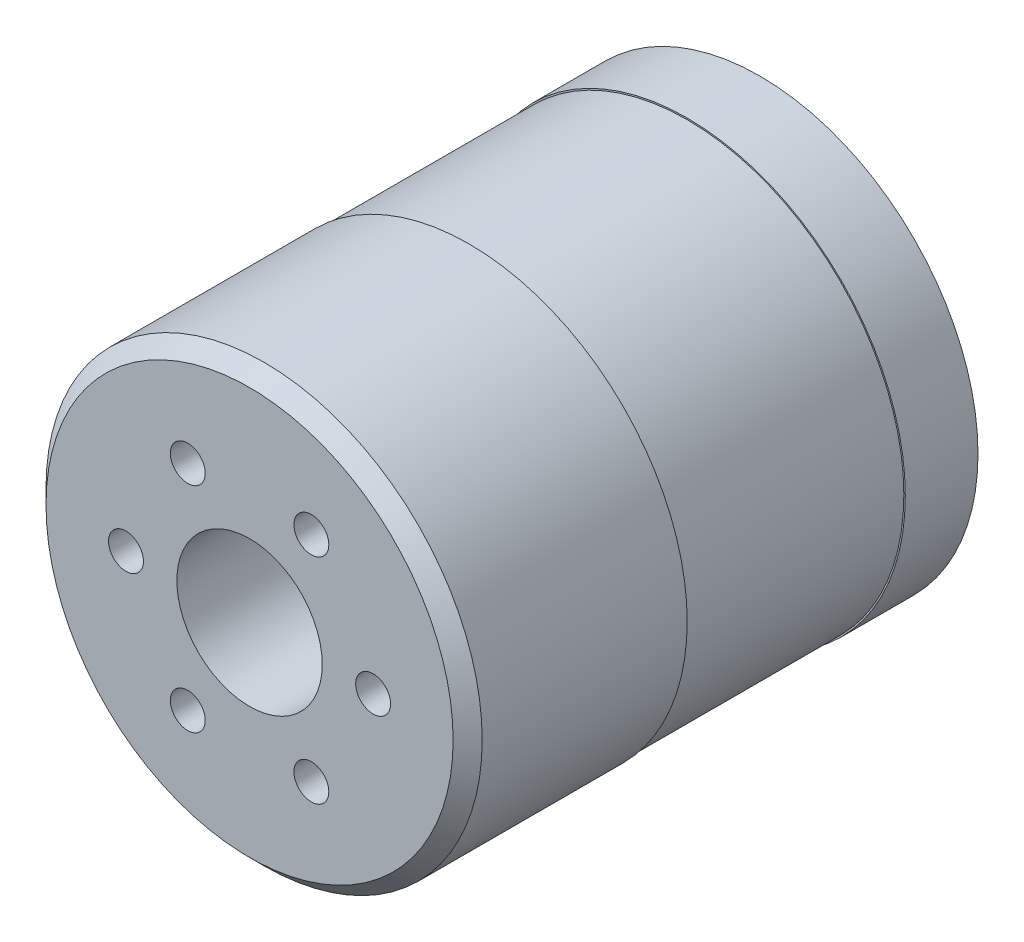
ISO-10303-21;
HEADER;
FILE_DESCRIPTION(('STEP AP214'),'2;1');
FILE_NAME('part.step','',(''),(''),'','','');
FILE_SCHEMA(('AUTOMOTIVE_DESIGN { 1 0 10303 214 1 1 1 1 }'));
ENDSEC;
DATA;
#1=APPLICATION_CONTEXT('core data for automotive mechanical design processes');
#2=APPLICATION_PROTOCOL_DEFINITION('international standard','automotive_design',2000,#1);
#3=PRODUCT_CONTEXT('',#1,'mechanical');
#4=PRODUCT('Part','Part','',(#3));
#5=PRODUCT_RELATED_PRODUCT_CATEGORY('part','',(#4));
#6=PRODUCT_DEFINITION_FORMATION('','',#4);
#7=PRODUCT_DEFINITION_CONTEXT('part definition',#1,'design');
#8=PRODUCT_DEFINITION('design','',#6,#7);
#9=PRODUCT_DEFINITION_SHAPE('','',#8);
#10=(LENGTH_UNIT() NAMED_UNIT(*) SI_UNIT(.MILLI.,.METRE.));
#11=(NAMED_UNIT(*) PLANE_ANGLE_UNIT() SI_UNIT($,.RADIAN.));
#12=(NAMED_UNIT(*) SI_UNIT($,.STERADIAN.) SOLID_ANGLE_UNIT());
#13=UNCERTAINTY_MEASURE_WITH_UNIT(LENGTH_MEASURE(1.E-05),#10,'distance_accuracy_value','');
#14=(GEOMETRIC_REPRESENTATION_CONTEXT(3) GLOBAL_UNCERTAINTY_ASSIGNED_CONTEXT((#13)) GLOBAL_UNIT_ASSIGNED_CONTEXT((#10,
#11,#12)) REPRESENTATION_CONTEXT('',''));
#15=CARTESIAN_POINT('',(0.,0.,0.));
#16=DIRECTION('',(0.,0.,1.));
#17=DIRECTION('',(1.,0.,0.));
#18=AXIS2_PLACEMENT_3D('',#15,#16,#17);
#19=CARTESIAN_POINT('',(0.,0.,0.));
#20=DIRECTION('',(0.,0.,1.));
#21=DIRECTION('',(1.,0.,0.));
#22=AXIS2_PLACEMENT_3D('',#19,#20,#21);
#23=PLANE('',#22);
#24=CARTESIAN_POINT('',(-13.,0.,0.));
#25=DIRECTION('',(0.,0.,-1.));
#26=DIRECTION('',(-1.,0.,0.));
#27=AXIS2_PLACEMENT_3D('',#24,#25,#26);
#28=CIRCLE('',#27,1.25);
#29=CARTESIAN_POINT('',(-14.25,0.,0.));
#30=VERTEX_POINT('',#29);
#31=EDGE_CURVE('E126',#30,#30,#28,.T.);
#32=ORIENTED_EDGE('',*,*,#31,.F.);
#33=EDGE_LOOP('',(#32));
#34=FACE_BOUND('',#33,.T.);
#35=CARTESIAN_POINT('',(0.,13.,0.));
#36=DIRECTION('',(0.,0.,-1.));
#37=DIRECTION('',(-1.,0.,0.));
#38=AXIS2_PLACEMENT_3D('',#35,#36,#37);
#39=CIRCLE('',#38,1.25);
#40=CARTESIAN_POINT('',(-1.25,13.,0.));
#41=VERTEX_POINT('',#40);
#42=EDGE_CURVE('E132',#41,#41,#39,.T.);
#43=ORIENTED_EDGE('',*,*,#42,.F.);
#44=EDGE_LOOP('',(#43));
#45=FACE_BOUND('',#44,.T.);
#46=CARTESIAN_POINT('',(13.,0.,0.));
#47=DIRECTION('',(0.,0.,-1.));
#48=DIRECTION('',(-1.,0.,0.));
#49=AXIS2_PLACEMENT_3D('',#46,#47,#48);
#50=CIRCLE('',#49,1.25);
#51=CARTESIAN_POINT('',(11.75,0.,0.));
#52=VERTEX_POINT('',#51);
#53=EDGE_CURVE('E138',#52,#52,#50,.T.);
#54=ORIENTED_EDGE('',*,*,#53,.F.);
#55=EDGE_LOOP('',(#54));
#56=FACE_BOUND('',#55,.T.);
#57=CARTESIAN_POINT('',(0.,-13.,0.));
#58=DIRECTION('',(0.,0.,-1.));
#59=DIRECTION('',(-1.,0.,0.));
#60=AXIS2_PLACEMENT_3D('',#57,#58,#59);
#61=CIRCLE('',#60,1.25);
#62=CARTESIAN_POINT('',(-1.25,-13.,0.));
#63=VERTEX_POINT('',#62);
#64=EDGE_CURVE('E144',#63,#63,#61,.T.);
#65=ORIENTED_EDGE('',*,*,#64,.F.);
#66=EDGE_LOOP('',(#65));
#67=FACE_BOUND('',#66,.T.);
#68=CARTESIAN_POINT('',(0.,0.,0.));
#69=DIRECTION('',(0.,0.,1.));
#70=DIRECTION('',(1.,0.,0.));
#71=AXIS2_PLACEMENT_3D('',#68,#69,#70);
#72=CIRCLE('',#71,9.);
#73=CARTESIAN_POINT('',(9.,0.,0.));
#74=VERTEX_POINT('',#73);
#75=EDGE_CURVE('E174',#74,#74,#72,.F.);
#76=ORIENTED_EDGE('',*,*,#75,.F.);
#77=EDGE_LOOP('',(#76));
#78=FACE_BOUND('',#77,.T.);
#79=CARTESIAN_POINT('',(0.,0.,0.));
#80=DIRECTION('',(0.,0.,-1.));
#81=DIRECTION('',(-1.,0.,0.));
#82=AXIS2_PLACEMENT_3D('',#79,#80,#81);
#83=CIRCLE('',#82,15.);
#84=CARTESIAN_POINT('',(-15.,0.,0.));
#85=VERTEX_POINT('',#84);
#86=EDGE_CURVE('E147',#85,#85,#83,.T.);
#87=ORIENTED_EDGE('',*,*,#86,.T.);
#88=EDGE_LOOP('',(#87));
#89=FACE_BOUND('',#88,.T.);
#90=ADVANCED_FACE('F32',(#34,#45,#56,#67,#78,#89),#23,.F.);
#91=CARTESIAN_POINT('',(0.,0.,-4.5));
#92=DIRECTION('',(0.,0.,-1.));
#93=DIRECTION('',(-1.,0.,0.));
#94=AXIS2_PLACEMENT_3D('',#91,#92,#93);
#95=PLANE('',#94);
#96=CARTESIAN_POINT('',(0.,0.,-4.5));
#97=DIRECTION('',(0.,0.,-1.));
#98=DIRECTION('',(-1.,0.,0.));
#99=AXIS2_PLACEMENT_3D('',#96,#97,#98);
#100=CIRCLE('',#99,5.);
#101=CARTESIAN_POINT('',(-5.,0.,-4.5));
#102=VERTEX_POINT('',#101);
#103=EDGE_CURVE('E166',#102,#102,#100,.T.);
#104=ORIENTED_EDGE('',*,*,#103,.T.);
#105=EDGE_LOOP('',(#104));
#106=FACE_BOUND('',#105,.T.);
#107=CARTESIAN_POINT('',(0.,0.,-4.5));
#108=DIRECTION('',(0.,0.,-1.));
#109=DIRECTION('',(-1.,0.,0.));
#110=AXIS2_PLACEMENT_3D('',#107,#108,#109);
#111=CIRCLE('',#110,4.);
#112=CARTESIAN_POINT('',(-4.,0.,-4.5));
#113=VERTEX_POINT('',#112);
#114=EDGE_CURVE('E162',#113,#113,#111,.T.);
#115=ORIENTED_EDGE('',*,*,#114,.F.);
#116=EDGE_LOOP('',(#115));
#117=FACE_BOUND('',#116,.T.);
#118=ADVANCED_FACE('F196',(#106,#117),#95,.T.);
#119=CARTESIAN_POINT('',(0.,0.,-4.));
#120=DIRECTION('',(0.,0.,-1.));
#121=DIRECTION('',(-1.,0.,0.));
#122=AXIS2_PLACEMENT_3D('',#119,#120,#121);
#123=PLANE('',#122);
#124=CARTESIAN_POINT('',(0.,0.,-4.));
#125=DIRECTION('',(0.,0.,-1.));
#126=DIRECTION('',(-1.,0.,0.));
#127=AXIS2_PLACEMENT_3D('',#124,#125,#126);
#128=CIRCLE('',#127,9.);
#129=CARTESIAN_POINT('',(-9.,0.,-4.));
#130=VERTEX_POINT('',#129);
#131=EDGE_CURVE('E169',#130,#130,#128,.T.);
#132=ORIENTED_EDGE('',*,*,#131,.T.);
#133=EDGE_LOOP('',(#132));
#134=FACE_BOUND('',#133,.T.);
#135=CARTESIAN_POINT('',(0.,0.,-4.));
#136=DIRECTION('',(0.,0.,-1.));
#137=DIRECTION('',(-1.,0.,0.));
#138=AXIS2_PLACEMENT_3D('',#135,#136,#137);
#139=CIRCLE('',#138,5.);
#140=CARTESIAN_POINT('',(-5.,0.,-4.));
#141=VERTEX_POINT('',#140);
#142=EDGE_CURVE('E165',#141,#141,#139,.T.);
#143=ORIENTED_EDGE('',*,*,#142,.F.);
#144=EDGE_LOOP('',(#143));
#145=FACE_BOUND('',#144,.T.);
#146=ADVANCED_FACE('F202',(#134,#145),#123,.T.);
#147=CARTESIAN_POINT('',(0.,0.,-4.));
#148=DIRECTION('',(0.,0.,1.));
#149=DIRECTION('',(1.,0.,0.));
#150=AXIS2_PLACEMENT_3D('',#147,#148,#149);
#151=CYLINDRICAL_SURFACE('',#150,9.);
#152=ORIENTED_EDGE('',*,*,#131,.F.);
#153=EDGE_LOOP('',(#152));
#154=FACE_BOUND('',#153,.T.);
#155=ORIENTED_EDGE('',*,*,#75,.T.);
#156=EDGE_LOOP('',(#155));
#157=FACE_BOUND('',#156,.T.);
#158=ADVANCED_FACE('F208',(#154,#157),#151,.T.);
#159=CARTESIAN_POINT('',(0.,0.,-4.5));
#160=DIRECTION('',(0.,0.,1.));
#161=DIRECTION('',(1.,0.,0.));
#162=AXIS2_PLACEMENT_3D('',#159,#160,#161);
#163=CYLINDRICAL_SURFACE('',#162,5.);
#164=ORIENTED_EDGE('',*,*,#103,.F.);
#165=EDGE_LOOP('',(#164));
#166=FACE_BOUND('',#165,.T.);
#167=ORIENTED_EDGE('',*,*,#142,.T.);
#168=EDGE_LOOP('',(#167));
#169=FACE_BOUND('',#168,.T.);
#170=ADVANCED_FACE('F211',(#166,#169),#163,.T.);
#171=CARTESIAN_POINT('',(0.,0.,-4.501));
#172=DIRECTION('',(0.,0.,1.));
#173=DIRECTION('',(1.,0.,0.));
#174=AXIS2_PLACEMENT_3D('',#171,#172,#173);
#175=CYLINDRICAL_SURFACE('',#174,4.);
#176=ORIENTED_EDGE('',*,*,#114,.T.);
#177=EDGE_LOOP('',(#176));
#178=FACE_BOUND('',#177,.T.);
#179=CARTESIAN_POINT('',(0.,0.,0.));
#180=DIRECTION('',(0.,0.,-1.));
#181=DIRECTION('',(-1.,0.,0.));
#182=AXIS2_PLACEMENT_3D('',#179,#180,#181);
#183=CIRCLE('',#182,4.);
#184=CARTESIAN_POINT('',(-4.,0.,0.));
#185=VERTEX_POINT('',#184);
#186=EDGE_CURVE('E159',#185,#185,#183,.T.);
#187=ORIENTED_EDGE('',*,*,#186,.F.);
#188=EDGE_LOOP('',(#187));
#189=FACE_BOUND('',#188,.T.);
#190=ADVANCED_FACE('F217',(#178,#189),#175,.F.);
#191=CARTESIAN_POINT('',(0.,0.,0.));
#192=DIRECTION('',(0.,0.,-1.));
#193=DIRECTION('',(-1.,0.,0.));
#194=AXIS2_PLACEMENT_3D('',#191,#192,#193);
#195=PLANE('',#194);
#196=ORIENTED_EDGE('',*,*,#186,.T.);
#197=EDGE_LOOP('',(#196));
#198=FACE_BOUND('',#197,.T.);
#199=ADVANCED_FACE('F222',(#198),#195,.T.);
#200=CARTESIAN_POINT('',(0.,0.,5.));
#201=DIRECTION('',(0.,0.,-1.));
#202=DIRECTION('',(-1.,0.,0.));
#203=AXIS2_PLACEMENT_3D('',#200,#201,#202);
#204=CYLINDRICAL_SURFACE('',#203,15.);
#205=CARTESIAN_POINT('',(0.,0.,5.));
#206=DIRECTION('',(0.,0.,-1.));
#207=DIRECTION('',(-1.,0.,0.));
#208=AXIS2_PLACEMENT_3D('',#205,#206,#207);
#209=CIRCLE('',#208,15.);
#210=CARTESIAN_POINT('',(-15.,0.,5.));
#211=VERTEX_POINT('',#210);
#212=EDGE_CURVE('E148',#211,#211,#209,.T.);
#213=ORIENTED_EDGE('',*,*,#212,.T.);
#214=EDGE_LOOP('',(#213));
#215=FACE_BOUND('',#214,.T.);
#216=ORIENTED_EDGE('',*,*,#86,.F.);
#217=EDGE_LOOP('',(#216));
#218=FACE_BOUND('',#217,.T.);
#219=ADVANCED_FACE('F226',(#215,#218),#204,.T.);
#220=CARTESIAN_POINT('',(0.,0.,5.));
#221=DIRECTION('',(0.,0.,-1.));
#222=DIRECTION('',(-1.,0.,0.));
#223=AXIS2_PLACEMENT_3D('',#220,#221,#222);
#224=PLANE('',#223);
#225=CARTESIAN_POINT('',(0.,0.,5.));
#226=DIRECTION('',(0.,0.,-1.));
#227=DIRECTION('',(-1.,0.,0.));
#228=AXIS2_PLACEMENT_3D('',#225,#226,#227);
#229=CIRCLE('',#228,14.9);
#230=CARTESIAN_POINT('',(-14.9,0.,5.));
#231=VERTEX_POINT('',#230);
#232=EDGE_CURVE('E36',#231,#231,#229,.F.);
#233=ORIENTED_EDGE('',*,*,#232,.F.);
#234=EDGE_LOOP('',(#233));
#235=FACE_BOUND('',#234,.T.);
#236=ORIENTED_EDGE('',*,*,#212,.F.);
#237=EDGE_LOOP('',(#236));
#238=FACE_BOUND('',#237,.T.);
#239=ADVANCED_FACE('F191',(#235,#238),#224,.F.);
#240=CARTESIAN_POINT('',(0.,0.,35.1));
#241=DIRECTION('',(0.,0.,1.));
#242=DIRECTION('',(1.,0.,0.));
#243=AXIS2_PLACEMENT_3D('',#240,#241,#242);
#244=PLANE('',#243);
#245=CARTESIAN_POINT('',(4.25000000000004,-7.36121593216771,35.1));
#246=DIRECTION('',(0.,0.,1.));
#247=DIRECTION('',(1.,0.,0.));
#248=AXIS2_PLACEMENT_3D('',#245,#246,#247);
#249=CIRCLE('',#248,1.19999999999999);
#250=CARTESIAN_POINT('',(5.45000000000003,-7.36121593216771,35.1));
#251=VERTEX_POINT('',#250);
#252=EDGE_CURVE('E83',#251,#251,#249,.T.);
#253=ORIENTED_EDGE('',*,*,#252,.F.);
#254=EDGE_LOOP('',(#253));
#255=FACE_BOUND('',#254,.T.);
#256=CARTESIAN_POINT('',(-4.24999999999998,-7.36121593216774,35.1));
#257=DIRECTION('',(0.,0.,1.));
#258=DIRECTION('',(1.,0.,0.));
#259=AXIS2_PLACEMENT_3D('',#256,#257,#258);
#260=CIRCLE('',#259,1.19999999999999);
#261=CARTESIAN_POINT('',(-3.04999999999999,-7.36121593216774,35.1));
#262=VERTEX_POINT('',#261);
#263=EDGE_CURVE('E82',#262,#262,#260,.T.);
#264=ORIENTED_EDGE('',*,*,#263,.F.);
#265=EDGE_LOOP('',(#264));
#266=FACE_BOUND('',#265,.T.);
#267=CARTESIAN_POINT('',(-8.5,0.,35.1));
#268=DIRECTION('',(0.,0.,1.));
#269=DIRECTION('',(1.,0.,0.));
#270=AXIS2_PLACEMENT_3D('',#267,#268,#269);
#271=CIRCLE('',#270,1.19999999999999);
#272=CARTESIAN_POINT('',(-7.30000000000001,0.,35.1));
#273=VERTEX_POINT('',#272);
#274=EDGE_CURVE('E93',#273,#273,#271,.T.);
#275=ORIENTED_EDGE('',*,*,#274,.F.);
#276=EDGE_LOOP('',(#275));
#277=FACE_BOUND('',#276,.T.);
#278=CARTESIAN_POINT('',(-4.25000000000004,7.36121593216771,35.1));
#279=DIRECTION('',(0.,0.,1.));
#280=DIRECTION('',(1.,0.,0.));
#281=AXIS2_PLACEMENT_3D('',#278,#279,#280);
#282=CIRCLE('',#281,1.19999999999999);
#283=CARTESIAN_POINT('',(-3.05000000000005,7.36121593216771,35.1));
#284=VERTEX_POINT('',#283);
#285=EDGE_CURVE('E99',#284,#284,#282,.T.);
#286=ORIENTED_EDGE('',*,*,#285,.F.);
#287=EDGE_LOOP('',(#286));
#288=FACE_BOUND('',#287,.T.);
#289=CARTESIAN_POINT('',(4.24999999999998,7.36121593216774,35.1));
#290=DIRECTION('',(0.,0.,1.));
#291=DIRECTION('',(1.,0.,0.));
#292=AXIS2_PLACEMENT_3D('',#289,#290,#291);
#293=CIRCLE('',#292,1.19999999999999);
#294=CARTESIAN_POINT('',(5.44999999999997,7.36121593216774,35.1));
#295=VERTEX_POINT('',#294);
#296=EDGE_CURVE('E105',#295,#295,#293,.T.);
#297=ORIENTED_EDGE('',*,*,#296,.F.);
#298=EDGE_LOOP('',(#297));
#299=FACE_BOUND('',#298,.T.);
#300=CARTESIAN_POINT('',(8.5,0.,35.1));
#301=DIRECTION('',(0.,0.,1.));
#302=DIRECTION('',(1.,0.,0.));
#303=AXIS2_PLACEMENT_3D('',#300,#301,#302);
#304=CIRCLE('',#303,1.19999999999999);
#305=CARTESIAN_POINT('',(9.69999999999999,0.,35.1));
#306=VERTEX_POINT('',#305);
#307=EDGE_CURVE('E111',#306,#306,#304,.T.);
#308=ORIENTED_EDGE('',*,*,#307,.F.);
#309=EDGE_LOOP('',(#308));
#310=FACE_BOUND('',#309,.T.);
#311=CARTESIAN_POINT('',(0.,0.,35.1));
#312=DIRECTION('',(0.,0.,1.));
#313=DIRECTION('',(1.,0.,0.));
#314=AXIS2_PLACEMENT_3D('',#311,#312,#313);
#315=CIRCLE('',#314,5.);
#316=CARTESIAN_POINT('',(5.,0.,35.1));
#317=VERTEX_POINT('',#316);
#318=EDGE_CURVE('E117',#317,#317,#315,.T.);
#319=ORIENTED_EDGE('',*,*,#318,.F.);
#320=EDGE_LOOP('',(#319));
#321=FACE_BOUND('',#320,.T.);
#322=CARTESIAN_POINT('',(0.,0.,35.1));
#323=DIRECTION('',(0.,0.,1.));
#324=DIRECTION('',(1.,0.,0.));
#325=AXIS2_PLACEMENT_3D('',#322,#323,#324);
#326=CIRCLE('',#325,14.);
#327=CARTESIAN_POINT('',(14.,0.,35.1));
#328=VERTEX_POINT('',#327);
#329=EDGE_CURVE('E41',#328,#328,#326,.T.);
#330=ORIENTED_EDGE('',*,*,#329,.T.);
#331=EDGE_LOOP('',(#330));
#332=FACE_BOUND('',#331,.T.);
#333=ADVANCED_FACE('F180',(#255,#266,#277,#288,#299,#310,#321,#332),#244,.T.);
#334=CARTESIAN_POINT('',(0.,0.,35.1));
#335=DIRECTION('',(0.,0.,-1.));
#336=DIRECTION('',(-1.,0.,0.));
#337=AXIS2_PLACEMENT_3D('',#334,#335,#336);
#338=CONICAL_SURFACE('',#337,14.,0.785398163397446);
#339=CARTESIAN_POINT('',(0.,0.,34.1));
#340=DIRECTION('',(0.,0.,1.));
#341=DIRECTION('',(1.,0.,0.));
#342=AXIS2_PLACEMENT_3D('',#339,#340,#341);
#343=CIRCLE('',#342,15.);
#344=CARTESIAN_POINT('',(15.,0.,34.1));
#345=VERTEX_POINT('',#344);
#346=EDGE_CURVE('E11',#345,#345,#343,.F.);
#347=ORIENTED_EDGE('',*,*,#346,.F.);
#348=EDGE_LOOP('',(#347));
#349=FACE_BOUND('',#348,.T.);
#350=ORIENTED_EDGE('',*,*,#329,.F.);
#351=EDGE_LOOP('',(#350));
#352=FACE_BOUND('',#351,.T.);
#353=ADVANCED_FACE('F34',(#349,#352),#338,.T.);
#354=CARTESIAN_POINT('',(0.,0.,35.1));
#355=DIRECTION('',(0.,0.,-1.));
#356=DIRECTION('',(-1.,0.,0.));
#357=AXIS2_PLACEMENT_3D('',#354,#355,#356);
#358=CYLINDRICAL_SURFACE('',#357,15.);
#359=ORIENTED_EDGE('',*,*,#346,.T.);
#360=EDGE_LOOP('',(#359));
#361=FACE_BOUND('',#360,.T.);
#362=CARTESIAN_POINT('',(0.,0.,20.));
#363=DIRECTION('',(0.,0.,-1.));
#364=DIRECTION('',(-1.,0.,0.));
#365=AXIS2_PLACEMENT_3D('',#362,#363,#364);
#366=CIRCLE('',#365,15.);
#367=CARTESIAN_POINT('',(-15.,0.,20.));
#368=VERTEX_POINT('',#367);
#369=EDGE_CURVE('E156',#368,#368,#366,.T.);
#370=ORIENTED_EDGE('',*,*,#369,.F.);
#371=EDGE_LOOP('',(#370));
#372=FACE_BOUND('',#371,.T.);
#373=ADVANCED_FACE('F183',(#361,#372),#358,.T.);
#374=CARTESIAN_POINT('',(0.,0.,20.));
#375=DIRECTION('',(0.,0.,-1.));
#376=DIRECTION('',(-1.,0.,0.));
#377=AXIS2_PLACEMENT_3D('',#374,#375,#376);
#378=PLANE('',#377);
#379=CARTESIAN_POINT('',(0.,0.,20.));
#380=DIRECTION('',(0.,0.,-1.));
#381=DIRECTION('',(-1.,0.,0.));
#382=AXIS2_PLACEMENT_3D('',#379,#380,#381);
#383=CIRCLE('',#382,14.9);
#384=CARTESIAN_POINT('',(-14.9,0.,20.));
#385=VERTEX_POINT('',#384);
#386=EDGE_CURVE('E153',#385,#385,#383,.T.);
#387=ORIENTED_EDGE('',*,*,#386,.F.);
#388=EDGE_LOOP('',(#387));
#389=FACE_BOUND('',#388,.T.);
#390=ORIENTED_EDGE('',*,*,#369,.T.);
#391=EDGE_LOOP('',(#390));
#392=FACE_BOUND('',#391,.T.);
#393=ADVANCED_FACE('F189',(#389,#392),#378,.T.);
#394=CARTESIAN_POINT('',(0.,0.,20.));
#395=DIRECTION('',(0.,0.,-1.));
#396=DIRECTION('',(-1.,0.,0.));
#397=AXIS2_PLACEMENT_3D('',#394,#395,#396);
#398=CYLINDRICAL_SURFACE('',#397,14.9);
#399=ORIENTED_EDGE('',*,*,#386,.T.);
#400=EDGE_LOOP('',(#399));
#401=FACE_BOUND('',#400,.T.);
#402=ORIENTED_EDGE('',*,*,#232,.T.);
#403=EDGE_LOOP('',(#402));
#404=FACE_BOUND('',#403,.T.);
#405=ADVANCED_FACE('F230',(#401,#404),#398,.T.);
#406=CARTESIAN_POINT('',(0.,-13.,0.));
#407=DIRECTION('',(0.,0.,-1.));
#408=DIRECTION('',(-1.,0.,0.));
#409=AXIS2_PLACEMENT_3D('',#406,#407,#408);
#410=CYLINDRICAL_SURFACE('',#409,1.25);
#411=CARTESIAN_POINT('',(0.,-13.,4.5));
#412=DIRECTION('',(0.,0.,-1.));
#413=DIRECTION('',(-1.,0.,0.));
#414=AXIS2_PLACEMENT_3D('',#411,#412,#413);
#415=CIRCLE('',#414,1.25);
#416=CARTESIAN_POINT('',(-1.25,-13.,4.5));
#417=VERTEX_POINT('',#416);
#418=EDGE_CURVE('E141',#417,#417,#415,.T.);
#419=ORIENTED_EDGE('',*,*,#418,.F.);
#420=EDGE_LOOP('',(#419));
#421=FACE_BOUND('',#420,.T.);
#422=ORIENTED_EDGE('',*,*,#64,.T.);
#423=EDGE_LOOP('',(#422));
#424=FACE_BOUND('',#423,.T.);
#425=ADVANCED_FACE('F234',(#421,#424),#410,.F.);
#426=CARTESIAN_POINT('',(0.,-13.,4.5));
#427=DIRECTION('',(0.,0.,-1.));
#428=DIRECTION('',(-1.,0.,0.));
#429=AXIS2_PLACEMENT_3D('',#426,#427,#428);
#430=CONICAL_SURFACE('',#429,1.25,1.02974425867665);
#431=CARTESIAN_POINT('',(0.,-13.,5.25107577378445));
#432=VERTEX_POINT('',#431);
#433=VERTEX_LOOP('',#432);
#434=FACE_BOUND('',#433,.T.);
#435=ORIENTED_EDGE('',*,*,#418,.T.);
#436=EDGE_LOOP('',(#435));
#437=FACE_BOUND('',#436,.T.);
#438=ADVANCED_FACE('F244',(#434,#437),#430,.F.);
#439=CARTESIAN_POINT('',(13.,0.,0.));
#440=DIRECTION('',(0.,0.,-1.));
#441=DIRECTION('',(-1.,0.,0.));
#442=AXIS2_PLACEMENT_3D('',#439,#440,#441);
#443=CYLINDRICAL_SURFACE('',#442,1.25);
#444=CARTESIAN_POINT('',(13.,0.,4.5));
#445=DIRECTION('',(0.,0.,-1.));
#446=DIRECTION('',(-1.,0.,0.));
#447=AXIS2_PLACEMENT_3D('',#444,#445,#446);
#448=CIRCLE('',#447,1.25);
#449=CARTESIAN_POINT('',(11.75,0.,4.5));
#450=VERTEX_POINT('',#449);
#451=EDGE_CURVE('E135',#450,#450,#448,.T.);
#452=ORIENTED_EDGE('',*,*,#451,.F.);
#453=EDGE_LOOP('',(#452));
#454=FACE_BOUND('',#453,.T.);
#455=ORIENTED_EDGE('',*,*,#53,.T.);
#456=EDGE_LOOP('',(#455));
#457=FACE_BOUND('',#456,.T.);
#458=ADVANCED_FACE('F248',(#454,#457),#443,.F.);
#459=CARTESIAN_POINT('',(13.,0.,4.5));
#460=DIRECTION('',(0.,0.,-1.));
#461=DIRECTION('',(-1.,0.,0.));
#462=AXIS2_PLACEMENT_3D('',#459,#460,#461);
#463=CONICAL_SURFACE('',#462,1.25,1.02974425867665);
#464=CARTESIAN_POINT('',(13.,0.,5.25107577378445));
#465=VERTEX_POINT('',#464);
#466=VERTEX_LOOP('',#465);
#467=FACE_BOUND('',#466,.T.);
#468=ORIENTED_EDGE('',*,*,#451,.T.);
#469=EDGE_LOOP('',(#468));
#470=FACE_BOUND('',#469,.T.);
#471=ADVANCED_FACE('F251',(#467,#470),#463,.F.);
#472=CARTESIAN_POINT('',(0.,13.,0.));
#473=DIRECTION('',(0.,0.,-1.));
#474=DIRECTION('',(-1.,0.,0.));
#475=AXIS2_PLACEMENT_3D('',#472,#473,#474);
#476=CYLINDRICAL_SURFACE('',#475,1.25);
#477=CARTESIAN_POINT('',(0.,13.,4.5));
#478=DIRECTION('',(0.,0.,-1.));
#479=DIRECTION('',(-1.,0.,0.));
#480=AXIS2_PLACEMENT_3D('',#477,#478,#479);
#481=CIRCLE('',#480,1.25);
#482=CARTESIAN_POINT('',(-1.25,13.,4.5));
#483=VERTEX_POINT('',#482);
#484=EDGE_CURVE('E129',#483,#483,#481,.T.);
#485=ORIENTED_EDGE('',*,*,#484,.F.);
#486=EDGE_LOOP('',(#485));
#487=FACE_BOUND('',#486,.T.);
#488=ORIENTED_EDGE('',*,*,#42,.T.);
#489=EDGE_LOOP('',(#488));
#490=FACE_BOUND('',#489,.T.);
#491=ADVANCED_FACE('F255',(#487,#490),#476,.F.);
#492=CARTESIAN_POINT('',(0.,13.,4.5));
#493=DIRECTION('',(0.,0.,-1.));
#494=DIRECTION('',(-1.,0.,0.));
#495=AXIS2_PLACEMENT_3D('',#492,#493,#494);
#496=CONICAL_SURFACE('',#495,1.25,1.02974425867665);
#497=CARTESIAN_POINT('',(0.,13.,5.25107577378445));
#498=VERTEX_POINT('',#497);
#499=VERTEX_LOOP('',#498);
#500=FACE_BOUND('',#499,.T.);
#501=ORIENTED_EDGE('',*,*,#484,.T.);
#502=EDGE_LOOP('',(#501));
#503=FACE_BOUND('',#502,.T.);
#504=ADVANCED_FACE('F258',(#500,#503),#496,.F.);
#505=CARTESIAN_POINT('',(-13.,0.,0.));
#506=DIRECTION('',(0.,0.,-1.));
#507=DIRECTION('',(-1.,0.,0.));
#508=AXIS2_PLACEMENT_3D('',#505,#506,#507);
#509=CYLINDRICAL_SURFACE('',#508,1.25);
#510=CARTESIAN_POINT('',(-13.,0.,4.5));
#511=DIRECTION('',(0.,0.,-1.));
#512=DIRECTION('',(-1.,0.,0.));
#513=AXIS2_PLACEMENT_3D('',#510,#511,#512);
#514=CIRCLE('',#513,1.25);
#515=CARTESIAN_POINT('',(-14.25,0.,4.5));
#516=VERTEX_POINT('',#515);
#517=EDGE_CURVE('E121',#516,#516,#514,.T.);
#518=ORIENTED_EDGE('',*,*,#517,.F.);
#519=EDGE_LOOP('',(#518));
#520=FACE_BOUND('',#519,.T.);
#521=ORIENTED_EDGE('',*,*,#31,.T.);
#522=EDGE_LOOP('',(#521));
#523=FACE_BOUND('',#522,.T.);
#524=ADVANCED_FACE('F262',(#520,#523),#509,.F.);
#525=CARTESIAN_POINT('',(-13.,0.,4.5));
#526=DIRECTION('',(0.,0.,-1.));
#527=DIRECTION('',(-1.,0.,0.));
#528=AXIS2_PLACEMENT_3D('',#525,#526,#527);
#529=CONICAL_SURFACE('',#528,1.25,1.02974425867665);
#530=CARTESIAN_POINT('',(-13.,0.,5.25107577378445));
#531=VERTEX_POINT('',#530);
#532=VERTEX_LOOP('',#531);
#533=FACE_BOUND('',#532,.T.);
#534=ORIENTED_EDGE('',*,*,#517,.T.);
#535=EDGE_LOOP('',(#534));
#536=FACE_BOUND('',#535,.T.);
#537=ADVANCED_FACE('F266',(#533,#536),#529,.F.);
#538=CARTESIAN_POINT('',(0.,0.,20.1));
#539=DIRECTION('',(0.,0.,1.));
#540=DIRECTION('',(1.,0.,0.));
#541=AXIS2_PLACEMENT_3D('',#538,#539,#540);
#542=CYLINDRICAL_SURFACE('',#541,5.);
#543=CARTESIAN_POINT('',(0.,0.,20.1));
#544=DIRECTION('',(0.,0.,1.));
#545=DIRECTION('',(1.,0.,0.));
#546=AXIS2_PLACEMENT_3D('',#543,#544,#545);
#547=CIRCLE('',#546,5.);
#548=CARTESIAN_POINT('',(5.,0.,20.1));
#549=VERTEX_POINT('',#548);
#550=EDGE_CURVE('E118',#549,#549,#547,.T.);
#551=ORIENTED_EDGE('',*,*,#550,.F.);
#552=EDGE_LOOP('',(#551));
#553=FACE_BOUND('',#552,.T.);
#554=ORIENTED_EDGE('',*,*,#318,.T.);
#555=EDGE_LOOP('',(#554));
#556=FACE_BOUND('',#555,.T.);
#557=ADVANCED_FACE('F270',(#553,#556),#542,.F.);
#558=CARTESIAN_POINT('',(0.,0.,20.1));
#559=DIRECTION('',(0.,0.,1.));
#560=DIRECTION('',(1.,0.,0.));
#561=AXIS2_PLACEMENT_3D('',#558,#559,#560);
#562=PLANE('',#561);
#563=ORIENTED_EDGE('',*,*,#550,.T.);
#564=EDGE_LOOP('',(#563));
#565=FACE_BOUND('',#564,.T.);
#566=ADVANCED_FACE('F274',(#565),#562,.T.);
#567=CARTESIAN_POINT('',(8.5,0.,32.1));
#568=DIRECTION('',(0.,0.,1.));
#569=DIRECTION('',(1.,0.,0.));
#570=AXIS2_PLACEMENT_3D('',#567,#568,#569);
#571=CONICAL_SURFACE('',#570,1.2,1.02974425867666);
#572=CARTESIAN_POINT('',(8.5,0.,31.3789672571669));
#573=VERTEX_POINT('',#572);
#574=VERTEX_LOOP('',#573);
#575=FACE_BOUND('',#574,.T.);
#576=CARTESIAN_POINT('',(8.5,0.,32.1));
#577=DIRECTION('',(0.,0.,1.));
#578=DIRECTION('',(1.,0.,0.));
#579=AXIS2_PLACEMENT_3D('',#576,#577,#578);
#580=CIRCLE('',#579,1.2);
#581=CARTESIAN_POINT('',(9.7,0.,32.1));
#582=VERTEX_POINT('',#581);
#583=EDGE_CURVE('E114',#582,#582,#580,.T.);
#584=ORIENTED_EDGE('',*,*,#583,.T.);
#585=EDGE_LOOP('',(#584));
#586=FACE_BOUND('',#585,.T.);
#587=ADVANCED_FACE('F278',(#575,#586),#571,.F.);
#588=CARTESIAN_POINT('',(8.5,0.,35.1));
#589=DIRECTION('',(0.,0.,1.));
#590=DIRECTION('',(1.,0.,0.));
#591=AXIS2_PLACEMENT_3D('',#588,#589,#590);
#592=CYLINDRICAL_SURFACE('',#591,1.19999999999999);
#593=ORIENTED_EDGE('',*,*,#583,.F.);
#594=EDGE_LOOP('',(#593));
#595=FACE_BOUND('',#594,.T.);
#596=ORIENTED_EDGE('',*,*,#307,.T.);
#597=EDGE_LOOP('',(#596));
#598=FACE_BOUND('',#597,.T.);
#599=ADVANCED_FACE('F282',(#595,#598),#592,.F.);
#600=CARTESIAN_POINT('',(4.24999999999998,7.36121593216774,32.1));
#601=DIRECTION('',(0.,0.,1.));
#602=DIRECTION('',(1.,0.,0.));
#603=AXIS2_PLACEMENT_3D('',#600,#601,#602);
#604=CONICAL_SURFACE('',#603,1.2,1.02974425867666);
#605=CARTESIAN_POINT('',(4.24999999999998,7.36121593216774,31.3789672571669));
#606=VERTEX_POINT('',#605);
#607=VERTEX_LOOP('',#606);
#608=FACE_BOUND('',#607,.T.);
#609=CARTESIAN_POINT('',(4.24999999999998,7.36121593216774,32.1));
#610=DIRECTION('',(0.,0.,1.));
#611=DIRECTION('',(1.,0.,0.));
#612=AXIS2_PLACEMENT_3D('',#609,#610,#611);
#613=CIRCLE('',#612,1.2);
#614=CARTESIAN_POINT('',(5.44999999999998,7.36121593216774,32.1));
#615=VERTEX_POINT('',#614);
#616=EDGE_CURVE('E108',#615,#615,#613,.T.);
#617=ORIENTED_EDGE('',*,*,#616,.T.);
#618=EDGE_LOOP('',(#617));
#619=FACE_BOUND('',#618,.T.);
#620=ADVANCED_FACE('F286',(#608,#619),#604,.F.);
#621=CARTESIAN_POINT('',(4.24999999999998,7.36121593216774,35.1));
#622=DIRECTION('',(0.,0.,1.));
#623=DIRECTION('',(1.,0.,0.));
#624=AXIS2_PLACEMENT_3D('',#621,#622,#623);
#625=CYLINDRICAL_SURFACE('',#624,1.19999999999999);
#626=ORIENTED_EDGE('',*,*,#616,.F.);
#627=EDGE_LOOP('',(#626));
#628=FACE_BOUND('',#627,.T.);
#629=ORIENTED_EDGE('',*,*,#296,.T.);
#630=EDGE_LOOP('',(#629));
#631=FACE_BOUND('',#630,.T.);
#632=ADVANCED_FACE('F290',(#628,#631),#625,.F.);
#633=CARTESIAN_POINT('',(-4.25000000000004,7.36121593216771,32.1));
#634=DIRECTION('',(0.,0.,1.));
#635=DIRECTION('',(1.,0.,0.));
#636=AXIS2_PLACEMENT_3D('',#633,#634,#635);
#637=CONICAL_SURFACE('',#636,1.2,1.02974425867666);
#638=CARTESIAN_POINT('',(-4.25000000000004,7.36121593216771,31.3789672571669));
#639=VERTEX_POINT('',#638);
#640=VERTEX_LOOP('',#639);
#641=FACE_BOUND('',#640,.T.);
#642=CARTESIAN_POINT('',(-4.25000000000004,7.36121593216771,32.1));
#643=DIRECTION('',(0.,0.,1.));
#644=DIRECTION('',(1.,0.,0.));
#645=AXIS2_PLACEMENT_3D('',#642,#643,#644);
#646=CIRCLE('',#645,1.2);
#647=CARTESIAN_POINT('',(-3.05000000000004,7.36121593216771,32.1));
#648=VERTEX_POINT('',#647);
#649=EDGE_CURVE('E102',#648,#648,#646,.T.);
#650=ORIENTED_EDGE('',*,*,#649,.T.);
#651=EDGE_LOOP('',(#650));
#652=FACE_BOUND('',#651,.T.);
#653=ADVANCED_FACE('F294',(#641,#652),#637,.F.);
#654=CARTESIAN_POINT('',(-4.25000000000004,7.36121593216771,35.1));
#655=DIRECTION('',(0.,0.,1.));
#656=DIRECTION('',(1.,0.,0.));
#657=AXIS2_PLACEMENT_3D('',#654,#655,#656);
#658=CYLINDRICAL_SURFACE('',#657,1.19999999999999);
#659=ORIENTED_EDGE('',*,*,#649,.F.);
#660=EDGE_LOOP('',(#659));
#661=FACE_BOUND('',#660,.T.);
#662=ORIENTED_EDGE('',*,*,#285,.T.);
#663=EDGE_LOOP('',(#662));
#664=FACE_BOUND('',#663,.T.);
#665=ADVANCED_FACE('F298',(#661,#664),#658,.F.);
#666=CARTESIAN_POINT('',(-8.5,0.,32.1));
#667=DIRECTION('',(0.,0.,1.));
#668=DIRECTION('',(1.,0.,0.));
#669=AXIS2_PLACEMENT_3D('',#666,#667,#668);
#670=CONICAL_SURFACE('',#669,1.2,1.02974425867666);
#671=CARTESIAN_POINT('',(-8.5,0.,31.3789672571669));
#672=VERTEX_POINT('',#671);
#673=VERTEX_LOOP('',#672);
#674=FACE_BOUND('',#673,.T.);
#675=CARTESIAN_POINT('',(-8.5,0.,32.1));
#676=DIRECTION('',(0.,0.,1.));
#677=DIRECTION('',(1.,0.,0.));
#678=AXIS2_PLACEMENT_3D('',#675,#676,#677);
#679=CIRCLE('',#678,1.2);
#680=CARTESIAN_POINT('',(-7.3,0.,32.1));
#681=VERTEX_POINT('',#680);
#682=EDGE_CURVE('E96',#681,#681,#679,.T.);
#683=ORIENTED_EDGE('',*,*,#682,.T.);
#684=EDGE_LOOP('',(#683));
#685=FACE_BOUND('',#684,.T.);
#686=ADVANCED_FACE('F302',(#674,#685),#670,.F.);
#687=CARTESIAN_POINT('',(-8.5,0.,35.1));
#688=DIRECTION('',(0.,0.,1.));
#689=DIRECTION('',(1.,0.,0.));
#690=AXIS2_PLACEMENT_3D('',#687,#688,#689);
#691=CYLINDRICAL_SURFACE('',#690,1.19999999999999);
#692=ORIENTED_EDGE('',*,*,#682,.F.);
#693=EDGE_LOOP('',(#692));
#694=FACE_BOUND('',#693,.T.);
#695=ORIENTED_EDGE('',*,*,#274,.T.);
#696=EDGE_LOOP('',(#695));
#697=FACE_BOUND('',#696,.T.);
#698=ADVANCED_FACE('F306',(#694,#697),#691,.F.);
#699=CARTESIAN_POINT('',(-4.24999999999998,-7.36121593216774,32.1));
#700=DIRECTION('',(0.,0.,1.));
#701=DIRECTION('',(1.,0.,0.));
#702=AXIS2_PLACEMENT_3D('',#699,#700,#701);
#703=CONICAL_SURFACE('',#702,1.2,1.02974425867666);
#704=CARTESIAN_POINT('',(-4.24999999999998,-7.36121593216774,31.3789672571669));
#705=VERTEX_POINT('',#704);
#706=VERTEX_LOOP('',#705);
#707=FACE_BOUND('',#706,.T.);
#708=CARTESIAN_POINT('',(-4.24999999999998,-7.36121593216774,32.1));
#709=DIRECTION('',(0.,0.,1.));
#710=DIRECTION('',(1.,0.,0.));
#711=AXIS2_PLACEMENT_3D('',#708,#709,#710);
#712=CIRCLE('',#711,1.2);
#713=CARTESIAN_POINT('',(-3.04999999999998,-7.36121593216774,32.1));
#714=VERTEX_POINT('',#713);
#715=EDGE_CURVE('E86',#714,#714,#712,.T.);
#716=ORIENTED_EDGE('',*,*,#715,.T.);
#717=EDGE_LOOP('',(#716));
#718=FACE_BOUND('',#717,.T.);
#719=ADVANCED_FACE('F310',(#707,#718),#703,.F.);
#720=CARTESIAN_POINT('',(-4.24999999999998,-7.36121593216774,35.1));
#721=DIRECTION('',(0.,0.,1.));
#722=DIRECTION('',(1.,0.,0.));
#723=AXIS2_PLACEMENT_3D('',#720,#721,#722);
#724=CYLINDRICAL_SURFACE('',#723,1.19999999999999);
#725=ORIENTED_EDGE('',*,*,#715,.F.);
#726=EDGE_LOOP('',(#725));
#727=FACE_BOUND('',#726,.T.);
#728=ORIENTED_EDGE('',*,*,#263,.T.);
#729=EDGE_LOOP('',(#728));
#730=FACE_BOUND('',#729,.T.);
#731=ADVANCED_FACE('F76',(#727,#730),#724,.F.);
#732=CARTESIAN_POINT('',(4.25000000000004,-7.36121593216771,32.1));
#733=DIRECTION('',(0.,0.,1.));
#734=DIRECTION('',(1.,0.,0.));
#735=AXIS2_PLACEMENT_3D('',#732,#733,#734);
#736=CONICAL_SURFACE('',#735,1.2,1.02974425867666);
#737=CARTESIAN_POINT('',(4.25000000000004,-7.36121593216771,31.3789672571669));
#738=VERTEX_POINT('',#737);
#739=VERTEX_LOOP('',#738);
#740=FACE_BOUND('',#739,.T.);
#741=CARTESIAN_POINT('',(4.25000000000004,-7.36121593216771,32.1));
#742=DIRECTION('',(0.,0.,1.));
#743=DIRECTION('',(1.,0.,0.));
#744=AXIS2_PLACEMENT_3D('',#741,#742,#743);
#745=CIRCLE('',#744,1.2);
#746=CARTESIAN_POINT('',(5.45000000000004,-7.36121593216771,32.1));
#747=VERTEX_POINT('',#746);
#748=EDGE_CURVE('E80',#747,#747,#745,.T.);
#749=ORIENTED_EDGE('',*,*,#748,.T.);
#750=EDGE_LOOP('',(#749));
#751=FACE_BOUND('',#750,.T.);
#752=ADVANCED_FACE('F72',(#740,#751),#736,.F.);
#753=CARTESIAN_POINT('',(4.25000000000004,-7.36121593216771,35.1));
#754=DIRECTION('',(0.,0.,1.));
#755=DIRECTION('',(1.,0.,0.));
#756=AXIS2_PLACEMENT_3D('',#753,#754,#755);
#757=CYLINDRICAL_SURFACE('',#756,1.19999999999999);
#758=ORIENTED_EDGE('',*,*,#748,.F.);
#759=EDGE_LOOP('',(#758));
#760=FACE_BOUND('',#759,.T.);
#761=ORIENTED_EDGE('',*,*,#252,.T.);
#762=EDGE_LOOP('',(#761));
#763=FACE_BOUND('',#762,.T.);
#764=ADVANCED_FACE('F75',(#760,#763),#757,.F.);
#765=CLOSED_SHELL('',(#90,#118,#146,#158,#170,#190,#199,#219,#239,#333,#353,#373,#393,#405,#425,
#438,#458,#471,#491,#504,#524,#537,#557,#566,#587,#599,#620,#632,#653,#665,#686,#698,#719,#731,
#752,#764));
#766=MANIFOLD_SOLID_BREP('B2',#765);
#767=ADVANCED_BREP_SHAPE_REPRESENTATION('',(#18,#766),#14);
#768=SHAPE_DEFINITION_REPRESENTATION(#9,#767);
ENDSEC;
END-ISO-10303-21;
